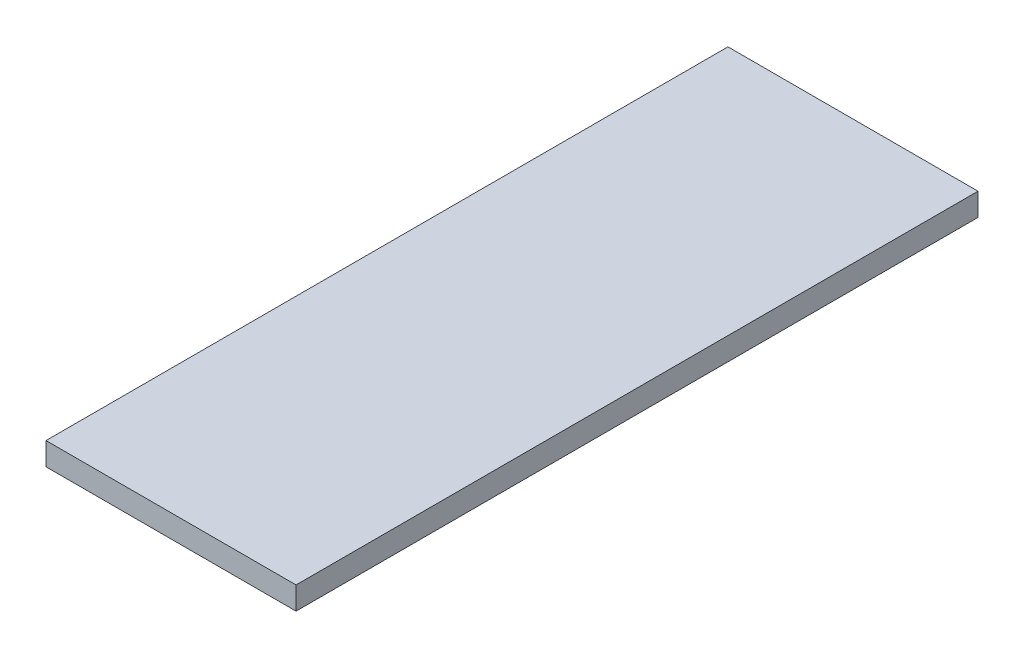
ISO-10303-21;
HEADER;
FILE_DESCRIPTION(('STEP AP214'),'2;1');
FILE_NAME('part.step','',(''),(''),'','','');
FILE_SCHEMA(('AUTOMOTIVE_DESIGN { 1 0 10303 214 1 1 1 1 }'));
ENDSEC;
DATA;
#1=APPLICATION_CONTEXT('core data for automotive mechanical design processes');
#2=APPLICATION_PROTOCOL_DEFINITION('international standard','automotive_design',2000,#1);
#3=PRODUCT_CONTEXT('',#1,'mechanical');
#4=PRODUCT('Part','Part','',(#3));
#5=PRODUCT_RELATED_PRODUCT_CATEGORY('part','',(#4));
#6=PRODUCT_DEFINITION_FORMATION('','',#4);
#7=PRODUCT_DEFINITION_CONTEXT('part definition',#1,'design');
#8=PRODUCT_DEFINITION('design','',#6,#7);
#9=PRODUCT_DEFINITION_SHAPE('','',#8);
#10=(LENGTH_UNIT() NAMED_UNIT(*) SI_UNIT(.MILLI.,.METRE.));
#11=(NAMED_UNIT(*) PLANE_ANGLE_UNIT() SI_UNIT($,.RADIAN.));
#12=(NAMED_UNIT(*) SI_UNIT($,.STERADIAN.) SOLID_ANGLE_UNIT());
#13=UNCERTAINTY_MEASURE_WITH_UNIT(LENGTH_MEASURE(1.E-05),#10,'distance_accuracy_value','');
#14=(GEOMETRIC_REPRESENTATION_CONTEXT(3) GLOBAL_UNCERTAINTY_ASSIGNED_CONTEXT((#13)) GLOBAL_UNIT_ASSIGNED_CONTEXT((#10,
#11,#12)) REPRESENTATION_CONTEXT('',''));
#15=CARTESIAN_POINT('',(0.,0.,0.));
#16=DIRECTION('',(0.,0.,1.));
#17=DIRECTION('',(1.,0.,0.));
#18=AXIS2_PLACEMENT_3D('',#15,#16,#17);
#19=CARTESIAN_POINT('',(-55.,10.,150.));
#20=DIRECTION('',(1.,0.,0.));
#21=DIRECTION('',(0.,0.,-1.));
#22=AXIS2_PLACEMENT_3D('',#19,#20,#21);
#23=PLANE('',#22);
#24=DIRECTION('',(0.,0.,1.));
#25=VECTOR('',#24,1.);
#26=CARTESIAN_POINT('',(-55.,0.,150.));
#27=LINE('',#26,#25);
#28=CARTESIAN_POINT('',(-55.,0.,-150.));
#29=VERTEX_POINT('',#28);
#30=CARTESIAN_POINT('',(-55.,0.,150.));
#31=VERTEX_POINT('',#30);
#32=EDGE_CURVE('E107',#29,#31,#27,.T.);
#33=ORIENTED_EDGE('',*,*,#32,.T.);
#34=DIRECTION('',(0.,-1.,0.));
#35=VECTOR('',#34,1.);
#36=CARTESIAN_POINT('',(-55.,10.,150.));
#37=LINE('',#36,#35);
#38=CARTESIAN_POINT('',(-55.,10.,150.));
#39=VERTEX_POINT('',#38);
#40=EDGE_CURVE('E11',#39,#31,#37,.T.);
#41=ORIENTED_EDGE('',*,*,#40,.F.);
#42=DIRECTION('',(0.,0.,1.));
#43=VECTOR('',#42,1.);
#44=CARTESIAN_POINT('',(-55.,10.,150.));
#45=LINE('',#44,#43);
#46=CARTESIAN_POINT('',(-55.,10.,-150.));
#47=VERTEX_POINT('',#46);
#48=EDGE_CURVE('E91',#47,#39,#45,.T.);
#49=ORIENTED_EDGE('',*,*,#48,.F.);
#50=DIRECTION('',(0.,-1.,0.));
#51=VECTOR('',#50,1.);
#52=CARTESIAN_POINT('',(-55.,10.,-150.));
#53=LINE('',#52,#51);
#54=EDGE_CURVE('E103',#47,#29,#53,.T.);
#55=ORIENTED_EDGE('',*,*,#54,.T.);
#56=EDGE_LOOP('',(#33,#41,#49,#55));
#57=FACE_BOUND('',#56,.T.);
#58=ADVANCED_FACE('F39',(#57),#23,.F.);
#59=CARTESIAN_POINT('',(-55.,10.,150.));
#60=DIRECTION('',(0.,0.,-1.));
#61=DIRECTION('',(-1.,0.,0.));
#62=AXIS2_PLACEMENT_3D('',#59,#60,#61);
#63=PLANE('',#62);
#64=DIRECTION('',(1.,0.,0.));
#65=VECTOR('',#64,1.);
#66=CARTESIAN_POINT('',(-55.,0.,150.));
#67=LINE('',#66,#65);
#68=CARTESIAN_POINT('',(55.,0.,150.));
#69=VERTEX_POINT('',#68);
#70=EDGE_CURVE('E96',#31,#69,#67,.T.);
#71=ORIENTED_EDGE('',*,*,#70,.T.);
#72=DIRECTION('',(0.,-1.,0.));
#73=VECTOR('',#72,1.);
#74=CARTESIAN_POINT('',(55.,10.,150.));
#75=LINE('',#74,#73);
#76=CARTESIAN_POINT('',(55.,10.,150.));
#77=VERTEX_POINT('',#76);
#78=EDGE_CURVE('E48',#77,#69,#75,.T.);
#79=ORIENTED_EDGE('',*,*,#78,.F.);
#80=DIRECTION('',(1.,0.,0.));
#81=VECTOR('',#80,1.);
#82=CARTESIAN_POINT('',(-55.,10.,150.));
#83=LINE('',#82,#81);
#84=EDGE_CURVE('E86',#39,#77,#83,.T.);
#85=ORIENTED_EDGE('',*,*,#84,.F.);
#86=ORIENTED_EDGE('',*,*,#40,.T.);
#87=EDGE_LOOP('',(#71,#79,#85,#86));
#88=FACE_BOUND('',#87,.T.);
#89=ADVANCED_FACE('F95',(#88),#63,.F.);
#90=CARTESIAN_POINT('',(55.,10.,150.));
#91=DIRECTION('',(-1.,0.,0.));
#92=DIRECTION('',(0.,0.,1.));
#93=AXIS2_PLACEMENT_3D('',#90,#91,#92);
#94=PLANE('',#93);
#95=DIRECTION('',(0.,0.,-1.));
#96=VECTOR('',#95,1.);
#97=CARTESIAN_POINT('',(55.,0.,150.));
#98=LINE('',#97,#96);
#99=CARTESIAN_POINT('',(55.,0.,-150.));
#100=VERTEX_POINT('',#99);
#101=EDGE_CURVE('E73',#69,#100,#98,.T.);
#102=ORIENTED_EDGE('',*,*,#101,.T.);
#103=DIRECTION('',(0.,-1.,0.));
#104=VECTOR('',#103,1.);
#105=CARTESIAN_POINT('',(55.,10.,-150.));
#106=LINE('',#105,#104);
#107=CARTESIAN_POINT('',(55.,10.,-150.));
#108=VERTEX_POINT('',#107);
#109=EDGE_CURVE('E98',#108,#100,#106,.T.);
#110=ORIENTED_EDGE('',*,*,#109,.F.);
#111=DIRECTION('',(0.,0.,-1.));
#112=VECTOR('',#111,1.);
#113=CARTESIAN_POINT('',(55.,10.,150.));
#114=LINE('',#113,#112);
#115=EDGE_CURVE('E89',#77,#108,#114,.T.);
#116=ORIENTED_EDGE('',*,*,#115,.F.);
#117=ORIENTED_EDGE('',*,*,#78,.T.);
#118=EDGE_LOOP('',(#102,#110,#116,#117));
#119=FACE_BOUND('',#118,.T.);
#120=ADVANCED_FACE('F99',(#119),#94,.F.);
#121=CARTESIAN_POINT('',(-55.,10.,-150.));
#122=DIRECTION('',(0.,0.,1.));
#123=DIRECTION('',(1.,0.,0.));
#124=AXIS2_PLACEMENT_3D('',#121,#122,#123);
#125=PLANE('',#124);
#126=DIRECTION('',(-1.,0.,0.));
#127=VECTOR('',#126,1.);
#128=CARTESIAN_POINT('',(-55.,0.,-150.));
#129=LINE('',#128,#127);
#130=EDGE_CURVE('E79',#100,#29,#129,.T.);
#131=ORIENTED_EDGE('',*,*,#130,.T.);
#132=ORIENTED_EDGE('',*,*,#54,.F.);
#133=DIRECTION('',(-1.,0.,0.));
#134=VECTOR('',#133,1.);
#135=CARTESIAN_POINT('',(-55.,10.,-150.));
#136=LINE('',#135,#134);
#137=EDGE_CURVE('E56',#108,#47,#136,.T.);
#138=ORIENTED_EDGE('',*,*,#137,.F.);
#139=ORIENTED_EDGE('',*,*,#109,.T.);
#140=EDGE_LOOP('',(#131,#132,#138,#139));
#141=FACE_BOUND('',#140,.T.);
#142=ADVANCED_FACE('F120',(#141),#125,.F.);
#143=CARTESIAN_POINT('',(0.,10.,0.));
#144=DIRECTION('',(0.,-1.,0.));
#145=DIRECTION('',(0.,0.,-1.));
#146=AXIS2_PLACEMENT_3D('',#143,#144,#145);
#147=PLANE('',#146);
#148=ORIENTED_EDGE('',*,*,#48,.T.);
#149=ORIENTED_EDGE('',*,*,#84,.T.);
#150=ORIENTED_EDGE('',*,*,#115,.T.);
#151=ORIENTED_EDGE('',*,*,#137,.T.);
#152=EDGE_LOOP('',(#148,#149,#150,#151));
#153=FACE_BOUND('',#152,.T.);
#154=ADVANCED_FACE('F87',(#153),#147,.F.);
#155=CARTESIAN_POINT('',(0.,0.,0.));
#156=DIRECTION('',(0.,-1.,0.));
#157=DIRECTION('',(0.,0.,-1.));
#158=AXIS2_PLACEMENT_3D('',#155,#156,#157);
#159=PLANE('',#158);
#160=ORIENTED_EDGE('',*,*,#32,.F.);
#161=ORIENTED_EDGE('',*,*,#130,.F.);
#162=ORIENTED_EDGE('',*,*,#101,.F.);
#163=ORIENTED_EDGE('',*,*,#70,.F.);
#164=EDGE_LOOP('',(#160,#161,#162,#163));
#165=FACE_BOUND('',#164,.T.);
#166=ADVANCED_FACE('F123',(#165),#159,.T.);
#167=CLOSED_SHELL('',(#58,#89,#120,#142,#154,#166));
#168=MANIFOLD_SOLID_BREP('B2',#167);
#169=ADVANCED_BREP_SHAPE_REPRESENTATION('',(#18,#168),#14);
#170=SHAPE_DEFINITION_REPRESENTATION(#9,#169);
ENDSEC;
END-ISO-10303-21;
